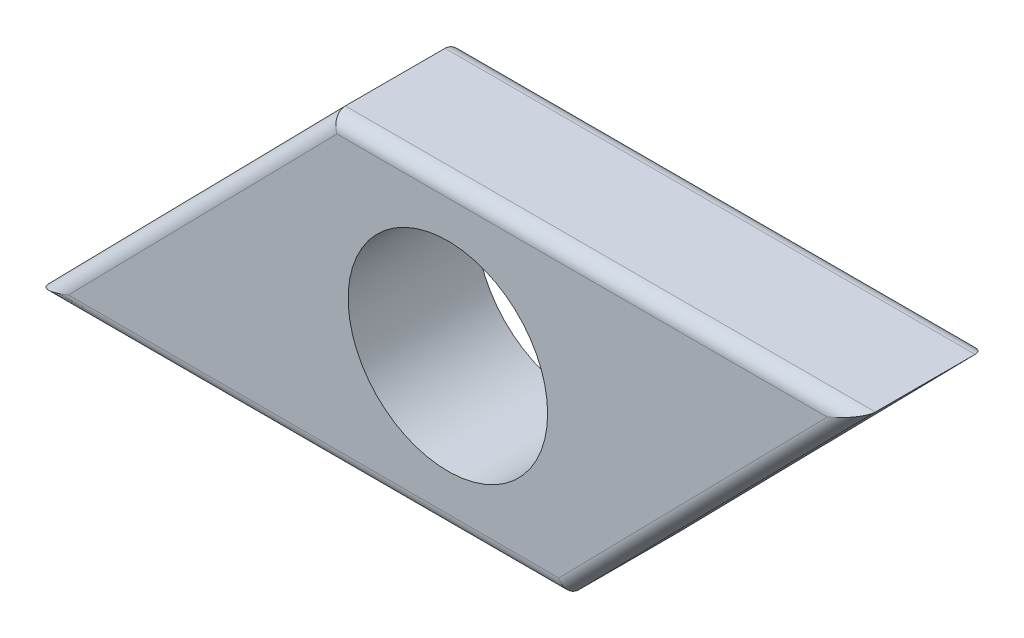
ISO-10303-21;
HEADER;
FILE_DESCRIPTION(('STEP AP214'),'2;1');
FILE_NAME('part.step','',(''),(''),'','','');
FILE_SCHEMA(('AUTOMOTIVE_DESIGN { 1 0 10303 214 1 1 1 1 }'));
ENDSEC;
DATA;
#1=APPLICATION_CONTEXT('core data for automotive mechanical design processes');
#2=APPLICATION_PROTOCOL_DEFINITION('international standard','automotive_design',2000,#1);
#3=PRODUCT_CONTEXT('',#1,'mechanical');
#4=PRODUCT('Part','Part','',(#3));
#5=PRODUCT_RELATED_PRODUCT_CATEGORY('part','',(#4));
#6=PRODUCT_DEFINITION_FORMATION('','',#4);
#7=PRODUCT_DEFINITION_CONTEXT('part definition',#1,'design');
#8=PRODUCT_DEFINITION('design','',#6,#7);
#9=PRODUCT_DEFINITION_SHAPE('','',#8);
#10=(LENGTH_UNIT() NAMED_UNIT(*) SI_UNIT(.MILLI.,.METRE.));
#11=(NAMED_UNIT(*) PLANE_ANGLE_UNIT() SI_UNIT($,.RADIAN.));
#12=(NAMED_UNIT(*) SI_UNIT($,.STERADIAN.) SOLID_ANGLE_UNIT());
#13=UNCERTAINTY_MEASURE_WITH_UNIT(LENGTH_MEASURE(1.E-05),#10,'distance_accuracy_value','');
#14=(GEOMETRIC_REPRESENTATION_CONTEXT(3) GLOBAL_UNCERTAINTY_ASSIGNED_CONTEXT((#13)) GLOBAL_UNIT_ASSIGNED_CONTEXT((#10,
#11,#12)) REPRESENTATION_CONTEXT('',''));
#15=CARTESIAN_POINT('',(0.,0.,0.));
#16=DIRECTION('',(0.,0.,1.));
#17=DIRECTION('',(1.,0.,0.));
#18=AXIS2_PLACEMENT_3D('',#15,#16,#17);
#19=CARTESIAN_POINT('',(-0.787810184205926,-1.61440170214372,2.25));
#20=DIRECTION('',(0.,0.,-1.));
#21=DIRECTION('',(-1.,0.,0.));
#22=AXIS2_PLACEMENT_3D('',#19,#20,#21);
#23=PLANE('',#22);
#24=DIRECTION('',(1.,0.,0.));
#25=VECTOR('',#24,1.);
#26=CARTESIAN_POINT('',(-0.787810184205926,-6.41440170214372,2.25));
#27=LINE('',#26,#25);
#28=CARTESIAN_POINT('',(-14.096776418891,-6.41440170214372,2.25));
#29=VERTEX_POINT('',#28);
#30=CARTESIAN_POINT('',(3.10228812595082,-6.41440170214372,2.25));
#31=VERTEX_POINT('',#30);
#32=EDGE_CURVE('E115',#29,#31,#27,.T.);
#33=ORIENTED_EDGE('',*,*,#32,.T.);
#34=DIRECTION('',(0.700340670128076,0.713808759938233,0.));
#35=VECTOR('',#34,1.);
#36=CARTESIAN_POINT('',(3.59384883143534,-5.91338790616911,2.25));
#37=LINE('',#36,#35);
#38=CARTESIAN_POINT('',(12.5211560504791,3.18559829785628,2.25));
#39=VERTEX_POINT('',#38);
#40=EDGE_CURVE('E9',#31,#39,#37,.T.);
#41=ORIENTED_EDGE('',*,*,#40,.T.);
#42=DIRECTION('',(-1.,0.,0.));
#43=VECTOR('',#42,1.);
#44=CARTESIAN_POINT('',(-0.787810184205926,3.18559829785628,2.25));
#45=LINE('',#44,#43);
#46=CARTESIAN_POINT('',(-4.67790849436266,3.18559829785628,2.25));
#47=VERTEX_POINT('',#46);
#48=EDGE_CURVE('E24',#39,#47,#45,.T.);
#49=ORIENTED_EDGE('',*,*,#48,.T.);
#50=DIRECTION('',(-0.700340670128077,-0.713808759938232,0.));
#51=VECTOR('',#50,1.);
#52=CARTESIAN_POINT('',(-5.16946919984719,2.68458450188167,2.25));
#53=LINE('',#52,#51);
#54=EDGE_CURVE('E133',#47,#29,#53,.T.);
#55=ORIENTED_EDGE('',*,*,#54,.T.);
#56=EDGE_LOOP('',(#33,#41,#49,#55));
#57=FACE_BOUND('',#56,.T.);
#58=CARTESIAN_POINT('',(-0.787810184205926,-1.61440170214372,2.25));
#59=DIRECTION('',(0.,0.,1.));
#60=DIRECTION('',(1.,0.,0.));
#61=AXIS2_PLACEMENT_3D('',#58,#59,#60);
#62=CIRCLE('',#61,3.5);
#63=CARTESIAN_POINT('',(2.71218981579407,-1.61440170214372,2.25));
#64=VERTEX_POINT('',#63);
#65=EDGE_CURVE('E160',#64,#64,#62,.T.);
#66=ORIENTED_EDGE('',*,*,#65,.F.);
#67=EDGE_LOOP('',(#66));
#68=FACE_BOUND('',#67,.T.);
#69=ADVANCED_FACE('F15',(#57,#68),#23,.F.);
#70=CARTESIAN_POINT('',(-0.787810184205926,-1.61440170214372,-2.25));
#71=DIRECTION('',(0.,0.,-1.));
#72=DIRECTION('',(-1.,0.,0.));
#73=AXIS2_PLACEMENT_3D('',#70,#71,#72);
#74=PLANE('',#73);
#75=DIRECTION('',(1.,0.,0.));
#76=VECTOR('',#75,1.);
#77=CARTESIAN_POINT('',(-15.2878101842059,-6.41440170214372,-2.25));
#78=LINE('',#77,#76);
#79=CARTESIAN_POINT('',(3.10228812595082,-6.41440170214372,-2.25));
#80=VERTEX_POINT('',#79);
#81=CARTESIAN_POINT('',(-14.096776418891,-6.41440170214372,-2.25));
#82=VERTEX_POINT('',#81);
#83=EDGE_CURVE('E151',#80,#82,#78,.F.);
#84=ORIENTED_EDGE('',*,*,#83,.T.);
#85=DIRECTION('',(-0.700340670128077,-0.713808759938232,0.));
#86=VECTOR('',#85,1.);
#87=CARTESIAN_POINT('',(-4.53090580423681,3.33542796279224,-2.25));
#88=LINE('',#87,#86);
#89=CARTESIAN_POINT('',(-4.67790849436266,3.18559829785628,-2.25));
#90=VERTEX_POINT('',#89);
#91=EDGE_CURVE('E144',#82,#90,#88,.F.);
#92=ORIENTED_EDGE('',*,*,#91,.T.);
#93=DIRECTION('',(-1.,0.,0.));
#94=VECTOR('',#93,1.);
#95=CARTESIAN_POINT('',(13.7121898157941,3.18559829785628,-2.25));
#96=LINE('',#95,#94);
#97=CARTESIAN_POINT('',(12.5211560504791,3.18559829785628,-2.25));
#98=VERTEX_POINT('',#97);
#99=EDGE_CURVE('E147',#90,#98,#96,.F.);
#100=ORIENTED_EDGE('',*,*,#99,.T.);
#101=DIRECTION('',(0.700340670128076,0.713808759938233,0.));
#102=VECTOR('',#101,1.);
#103=CARTESIAN_POINT('',(2.95528543582497,-6.56423136707969,-2.25));
#104=LINE('',#103,#102);
#105=EDGE_CURVE('E149',#98,#80,#104,.F.);
#106=ORIENTED_EDGE('',*,*,#105,.T.);
#107=EDGE_LOOP('',(#84,#92,#100,#106));
#108=FACE_BOUND('',#107,.T.);
#109=CARTESIAN_POINT('',(-0.787810184205926,-1.61440170214372,-2.25));
#110=DIRECTION('',(0.,0.,1.));
#111=DIRECTION('',(1.,0.,0.));
#112=AXIS2_PLACEMENT_3D('',#109,#110,#111);
#113=CIRCLE('',#112,3.5);
#114=CARTESIAN_POINT('',(2.71218981579407,-1.61440170214372,-2.25));
#115=VERTEX_POINT('',#114);
#116=EDGE_CURVE('E127',#115,#115,#113,.T.);
#117=ORIENTED_EDGE('',*,*,#116,.T.);
#118=EDGE_LOOP('',(#117));
#119=FACE_BOUND('',#118,.T.);
#120=ADVANCED_FACE('F170',(#108,#119),#74,.T.);
#121=CARTESIAN_POINT('',(-15.2878101842059,-6.91440170214372,2.25));
#122=DIRECTION('',(0.713808759938232,-0.700340670128077,0.));
#123=DIRECTION('',(0.700340670128077,0.713808759938232,0.));
#124=AXIS2_PLACEMENT_3D('',#121,#122,#123);
#125=PLANE('',#124);
#126=DIRECTION('',(0.,0.,-1.));
#127=VECTOR('',#126,1.);
#128=CARTESIAN_POINT('',(-4.88781018420593,3.68559829785628,2.25));
#129=LINE('',#128,#127);
#130=CARTESIAN_POINT('',(-4.88781018420593,3.68559829785628,1.75));
#131=VERTEX_POINT('',#130);
#132=CARTESIAN_POINT('',(-4.88781018420593,3.68559829785628,-1.75));
#133=VERTEX_POINT('',#132);
#134=EDGE_CURVE('E158',#131,#133,#129,.T.);
#135=ORIENTED_EDGE('',*,*,#134,.T.);
#136=DIRECTION('',(-0.700340670128077,-0.713808759938232,0.));
#137=VECTOR('',#136,1.);
#138=CARTESIAN_POINT('',(-15.2878101842059,-6.91440170214372,-1.75));
#139=LINE('',#138,#137);
#140=CARTESIAN_POINT('',(-15.2878101842059,-6.91440170214372,-1.75));
#141=VERTEX_POINT('',#140);
#142=EDGE_CURVE('E104',#133,#141,#139,.T.);
#143=ORIENTED_EDGE('',*,*,#142,.T.);
#144=DIRECTION('',(0.,0.,-1.));
#145=VECTOR('',#144,1.);
#146=CARTESIAN_POINT('',(-15.2878101842059,-6.91440170214372,2.25));
#147=LINE('',#146,#145);
#148=CARTESIAN_POINT('',(-15.2878101842059,-6.91440170214372,1.75));
#149=VERTEX_POINT('',#148);
#150=EDGE_CURVE('E86',#149,#141,#147,.T.);
#151=ORIENTED_EDGE('',*,*,#150,.F.);
#152=DIRECTION('',(-0.700340670128077,-0.713808759938232,0.));
#153=VECTOR('',#152,1.);
#154=CARTESIAN_POINT('',(-15.2878101842059,-6.91440170214372,1.75));
#155=LINE('',#154,#153);
#156=EDGE_CURVE('E101',#149,#131,#155,.F.);
#157=ORIENTED_EDGE('',*,*,#156,.T.);
#158=EDGE_LOOP('',(#135,#143,#151,#157));
#159=FACE_BOUND('',#158,.T.);
#160=ADVANCED_FACE('F100',(#159),#125,.F.);
#161=CARTESIAN_POINT('',(3.31218981579409,-6.91440170214372,2.25));
#162=DIRECTION('',(0.,1.,0.));
#163=DIRECTION('',(0.,0.,1.));
#164=AXIS2_PLACEMENT_3D('',#161,#162,#163);
#165=PLANE('',#164);
#166=ORIENTED_EDGE('',*,*,#150,.T.);
#167=DIRECTION('',(1.,0.,0.));
#168=VECTOR('',#167,1.);
#169=CARTESIAN_POINT('',(3.31218981579409,-6.91440170214372,-1.75));
#170=LINE('',#169,#168);
#171=CARTESIAN_POINT('',(3.31218981579409,-6.91440170214372,-1.75));
#172=VERTEX_POINT('',#171);
#173=EDGE_CURVE('E93',#141,#172,#170,.T.);
#174=ORIENTED_EDGE('',*,*,#173,.T.);
#175=DIRECTION('',(0.,0.,-1.));
#176=VECTOR('',#175,1.);
#177=CARTESIAN_POINT('',(3.31218981579409,-6.91440170214372,2.25));
#178=LINE('',#177,#176);
#179=CARTESIAN_POINT('',(3.31218981579409,-6.91440170214372,1.75));
#180=VERTEX_POINT('',#179);
#181=EDGE_CURVE('E88',#180,#172,#178,.T.);
#182=ORIENTED_EDGE('',*,*,#181,.F.);
#183=DIRECTION('',(1.,0.,0.));
#184=VECTOR('',#183,1.);
#185=CARTESIAN_POINT('',(3.31218981579409,-6.91440170214372,1.75));
#186=LINE('',#185,#184);
#187=EDGE_CURVE('E83',#180,#149,#186,.F.);
#188=ORIENTED_EDGE('',*,*,#187,.T.);
#189=EDGE_LOOP('',(#166,#174,#182,#188));
#190=FACE_BOUND('',#189,.T.);
#191=ADVANCED_FACE('F85',(#190),#165,.F.);
#192=CARTESIAN_POINT('',(13.7121898157941,3.68559829785628,2.25));
#193=DIRECTION('',(-0.713808759938232,0.700340670128076,0.));
#194=DIRECTION('',(-0.700340670128076,-0.713808759938233,0.));
#195=AXIS2_PLACEMENT_3D('',#192,#193,#194);
#196=PLANE('',#195);
#197=ORIENTED_EDGE('',*,*,#181,.T.);
#198=DIRECTION('',(0.700340670128076,0.713808759938233,0.));
#199=VECTOR('',#198,1.);
#200=CARTESIAN_POINT('',(13.7121898157941,3.68559829785628,-1.75));
#201=LINE('',#200,#199);
#202=CARTESIAN_POINT('',(13.7121898157941,3.68559829785628,-1.75));
#203=VERTEX_POINT('',#202);
#204=EDGE_CURVE('E94',#172,#203,#201,.T.);
#205=ORIENTED_EDGE('',*,*,#204,.T.);
#206=DIRECTION('',(0.,0.,-1.));
#207=VECTOR('',#206,1.);
#208=CARTESIAN_POINT('',(13.7121898157941,3.68559829785628,2.25));
#209=LINE('',#208,#207);
#210=CARTESIAN_POINT('',(13.7121898157941,3.68559829785628,1.75));
#211=VERTEX_POINT('',#210);
#212=EDGE_CURVE('E155',#211,#203,#209,.T.);
#213=ORIENTED_EDGE('',*,*,#212,.F.);
#214=DIRECTION('',(0.700340670128076,0.713808759938233,0.));
#215=VECTOR('',#214,1.);
#216=CARTESIAN_POINT('',(13.7121898157941,3.68559829785628,1.75));
#217=LINE('',#216,#215);
#218=EDGE_CURVE('E138',#211,#180,#217,.F.);
#219=ORIENTED_EDGE('',*,*,#218,.T.);
#220=EDGE_LOOP('',(#197,#205,#213,#219));
#221=FACE_BOUND('',#220,.T.);
#222=ADVANCED_FACE('F183',(#221),#196,.F.);
#223=CARTESIAN_POINT('',(-4.88781018420593,3.68559829785628,2.25));
#224=DIRECTION('',(0.,-1.,0.));
#225=DIRECTION('',(0.,0.,-1.));
#226=AXIS2_PLACEMENT_3D('',#223,#224,#225);
#227=PLANE('',#226);
#228=ORIENTED_EDGE('',*,*,#212,.T.);
#229=DIRECTION('',(-1.,0.,0.));
#230=VECTOR('',#229,1.);
#231=CARTESIAN_POINT('',(-4.88781018420593,3.68559829785628,-1.75));
#232=LINE('',#231,#230);
#233=EDGE_CURVE('E140',#203,#133,#232,.T.);
#234=ORIENTED_EDGE('',*,*,#233,.T.);
#235=ORIENTED_EDGE('',*,*,#134,.F.);
#236=DIRECTION('',(-1.,0.,0.));
#237=VECTOR('',#236,1.);
#238=CARTESIAN_POINT('',(-4.88781018420593,3.68559829785628,1.75));
#239=LINE('',#238,#237);
#240=EDGE_CURVE('E142',#131,#211,#239,.F.);
#241=ORIENTED_EDGE('',*,*,#240,.T.);
#242=EDGE_LOOP('',(#228,#234,#235,#241));
#243=FACE_BOUND('',#242,.T.);
#244=ADVANCED_FACE('F180',(#243),#227,.F.);
#245=CARTESIAN_POINT('',(-0.787810184205926,-1.61440170214372,2.25));
#246=DIRECTION('',(0.,0.,-1.));
#247=DIRECTION('',(-1.,0.,0.));
#248=AXIS2_PLACEMENT_3D('',#245,#246,#247);
#249=CYLINDRICAL_SURFACE('',#248,3.5);
#250=ORIENTED_EDGE('',*,*,#65,.T.);
#251=EDGE_LOOP('',(#250));
#252=FACE_BOUND('',#251,.T.);
#253=ORIENTED_EDGE('',*,*,#116,.F.);
#254=EDGE_LOOP('',(#253));
#255=FACE_BOUND('',#254,.T.);
#256=ADVANCED_FACE('F166',(#252,#255),#249,.F.);
#257=CARTESIAN_POINT('',(13.355285435825,4.03576863292032,-1.75));
#258=DIRECTION('',(-0.700340670128076,-0.713808759938233,0.));
#259=DIRECTION('',(0.713808759938233,-0.700340670128076,0.));
#260=AXIS2_PLACEMENT_3D('',#257,#258,#259);
#261=CYLINDRICAL_SURFACE('',#260,0.5);
#262=CARTESIAN_POINT('',(3.10228812595082,-6.41440170214372,-1.75));
#263=DIRECTION('',(-0.922046818260352,-0.387078370534911,0.));
#264=DIRECTION('',(-0.387078370534911,0.922046818260352,0.));
#265=AXIS2_PLACEMENT_3D('',#262,#263,#264);
#266=ELLIPSE('',#265,0.542271813207232,0.5);
#267=EDGE_CURVE('E128',#80,#172,#266,.T.);
#268=ORIENTED_EDGE('',*,*,#267,.F.);
#269=ORIENTED_EDGE('',*,*,#105,.F.);
#270=CARTESIAN_POINT('',(12.5211560504791,3.18559829785628,-1.75));
#271=DIRECTION('',(0.387078370534911,-0.922046818260352,0.));
#272=DIRECTION('',(-0.922046818260352,-0.387078370534911,0.));
#273=AXIS2_PLACEMENT_3D('',#270,#271,#272);
#274=ELLIPSE('',#273,1.29172807901676,0.5);
#275=EDGE_CURVE('E124',#203,#98,#274,.F.);
#276=ORIENTED_EDGE('',*,*,#275,.F.);
#277=ORIENTED_EDGE('',*,*,#204,.F.);
#278=EDGE_LOOP('',(#268,#269,#276,#277));
#279=FACE_BOUND('',#278,.T.);
#280=ADVANCED_FACE('F203',(#279),#261,.T.);
#281=CARTESIAN_POINT('',(-4.88781018420593,3.18559829785628,-1.75));
#282=DIRECTION('',(1.,0.,0.));
#283=DIRECTION('',(0.,0.,-1.));
#284=AXIS2_PLACEMENT_3D('',#281,#282,#283);
#285=CYLINDRICAL_SURFACE('',#284,0.5);
#286=ORIENTED_EDGE('',*,*,#275,.T.);
#287=ORIENTED_EDGE('',*,*,#99,.F.);
#288=CARTESIAN_POINT('',(-4.67790849436266,3.18559829785628,-1.75));
#289=DIRECTION('',(0.922046818260352,0.387078370534911,0.));
#290=DIRECTION('',(0.387078370534911,-0.922046818260352,0.));
#291=AXIS2_PLACEMENT_3D('',#288,#289,#290);
#292=ELLIPSE('',#291,0.542271813207232,0.5);
#293=EDGE_CURVE('E117',#133,#90,#292,.F.);
#294=ORIENTED_EDGE('',*,*,#293,.F.);
#295=ORIENTED_EDGE('',*,*,#233,.F.);
#296=EDGE_LOOP('',(#286,#287,#294,#295));
#297=FACE_BOUND('',#296,.T.);
#298=ADVANCED_FACE('F199',(#297),#285,.T.);
#299=CARTESIAN_POINT('',(3.31218981579409,-6.41440170214372,-1.75));
#300=DIRECTION('',(-1.,0.,0.));
#301=DIRECTION('',(0.,0.,1.));
#302=AXIS2_PLACEMENT_3D('',#299,#300,#301);
#303=CYLINDRICAL_SURFACE('',#302,0.5);
#304=ORIENTED_EDGE('',*,*,#267,.T.);
#305=ORIENTED_EDGE('',*,*,#173,.F.);
#306=CARTESIAN_POINT('',(-14.096776418891,-6.41440170214372,-1.75));
#307=DIRECTION('',(-0.387078370534911,0.922046818260352,0.));
#308=DIRECTION('',(-0.922046818260352,-0.387078370534911,0.));
#309=AXIS2_PLACEMENT_3D('',#306,#307,#308);
#310=ELLIPSE('',#309,1.29172807901677,0.5);
#311=EDGE_CURVE('E116',#82,#141,#310,.T.);
#312=ORIENTED_EDGE('',*,*,#311,.F.);
#313=ORIENTED_EDGE('',*,*,#83,.F.);
#314=EDGE_LOOP('',(#304,#305,#312,#313));
#315=FACE_BOUND('',#314,.T.);
#316=ADVANCED_FACE('F195',(#315),#303,.T.);
#317=CARTESIAN_POINT('',(-14.9309058042368,-7.26457203720776,-1.75));
#318=DIRECTION('',(0.700340670128077,0.713808759938232,0.));
#319=DIRECTION('',(-0.713808759938232,0.700340670128077,0.));
#320=AXIS2_PLACEMENT_3D('',#317,#318,#319);
#321=CYLINDRICAL_SURFACE('',#320,0.5);
#322=ORIENTED_EDGE('',*,*,#293,.T.);
#323=ORIENTED_EDGE('',*,*,#91,.F.);
#324=ORIENTED_EDGE('',*,*,#311,.T.);
#325=ORIENTED_EDGE('',*,*,#142,.F.);
#326=EDGE_LOOP('',(#322,#323,#324,#325));
#327=FACE_BOUND('',#326,.T.);
#328=ADVANCED_FACE('F192',(#327),#321,.T.);
#329=CARTESIAN_POINT('',(-5.16946919984719,2.68458450188167,1.75));
#330=DIRECTION('',(-0.700340670128077,-0.713808759938232,0.));
#331=DIRECTION('',(0.713808759938232,-0.700340670128077,0.));
#332=AXIS2_PLACEMENT_3D('',#329,#330,#331);
#333=CYLINDRICAL_SURFACE('',#332,0.5);
#334=CARTESIAN_POINT('',(-4.67790849436266,3.18559829785628,1.75));
#335=DIRECTION('',(-0.922046818260352,-0.387078370534911,0.));
#336=DIRECTION('',(0.387078370534911,-0.922046818260352,0.));
#337=AXIS2_PLACEMENT_3D('',#334,#335,#336);
#338=ELLIPSE('',#337,0.542271813207232,0.5);
#339=EDGE_CURVE('E111',#131,#47,#338,.F.);
#340=ORIENTED_EDGE('',*,*,#339,.F.);
#341=ORIENTED_EDGE('',*,*,#156,.F.);
#342=CARTESIAN_POINT('',(-14.096776418891,-6.41440170214372,1.75));
#343=DIRECTION('',(0.387078370534911,-0.922046818260352,0.));
#344=DIRECTION('',(0.922046818260352,0.387078370534911,0.));
#345=AXIS2_PLACEMENT_3D('',#342,#343,#344);
#346=ELLIPSE('',#345,1.29172807901677,0.5);
#347=EDGE_CURVE('E19',#29,#149,#346,.T.);
#348=ORIENTED_EDGE('',*,*,#347,.F.);
#349=ORIENTED_EDGE('',*,*,#54,.F.);
#350=EDGE_LOOP('',(#340,#341,#348,#349));
#351=FACE_BOUND('',#350,.T.);
#352=ADVANCED_FACE('F17',(#351),#333,.T.);
#353=CARTESIAN_POINT('',(-0.787810184205926,-6.41440170214372,1.75));
#354=DIRECTION('',(1.,0.,0.));
#355=DIRECTION('',(0.,0.,-1.));
#356=AXIS2_PLACEMENT_3D('',#353,#354,#355);
#357=CYLINDRICAL_SURFACE('',#356,0.5);
#358=ORIENTED_EDGE('',*,*,#347,.T.);
#359=ORIENTED_EDGE('',*,*,#187,.F.);
#360=CARTESIAN_POINT('',(3.10228812595082,-6.41440170214372,1.75));
#361=DIRECTION('',(0.922046818260352,0.387078370534911,0.));
#362=DIRECTION('',(0.387078370534911,-0.922046818260352,0.));
#363=AXIS2_PLACEMENT_3D('',#360,#361,#362);
#364=ELLIPSE('',#363,0.542271813207232,0.5);
#365=EDGE_CURVE('E119',#31,#180,#364,.T.);
#366=ORIENTED_EDGE('',*,*,#365,.F.);
#367=ORIENTED_EDGE('',*,*,#32,.F.);
#368=EDGE_LOOP('',(#358,#359,#366,#367));
#369=FACE_BOUND('',#368,.T.);
#370=ADVANCED_FACE('F114',(#369),#357,.T.);
#371=CARTESIAN_POINT('',(-0.787810184205926,3.18559829785628,1.75));
#372=DIRECTION('',(-1.,0.,0.));
#373=DIRECTION('',(0.,0.,1.));
#374=AXIS2_PLACEMENT_3D('',#371,#372,#373);
#375=CYLINDRICAL_SURFACE('',#374,0.5);
#376=ORIENTED_EDGE('',*,*,#339,.T.);
#377=ORIENTED_EDGE('',*,*,#48,.F.);
#378=CARTESIAN_POINT('',(12.5211560504791,3.18559829785628,1.75));
#379=DIRECTION('',(-0.387078370534911,0.922046818260352,0.));
#380=DIRECTION('',(-0.922046818260352,-0.387078370534911,0.));
#381=AXIS2_PLACEMENT_3D('',#378,#379,#380);
#382=ELLIPSE('',#381,1.29172807901676,0.5);
#383=EDGE_CURVE('E32',#211,#39,#382,.F.);
#384=ORIENTED_EDGE('',*,*,#383,.F.);
#385=ORIENTED_EDGE('',*,*,#240,.F.);
#386=EDGE_LOOP('',(#376,#377,#384,#385));
#387=FACE_BOUND('',#386,.T.);
#388=ADVANCED_FACE('F211',(#387),#375,.T.);
#389=CARTESIAN_POINT('',(3.59384883143534,-5.91338790616911,1.75));
#390=DIRECTION('',(0.700340670128076,0.713808759938233,0.));
#391=DIRECTION('',(-0.713808759938233,0.700340670128076,0.));
#392=AXIS2_PLACEMENT_3D('',#389,#390,#391);
#393=CYLINDRICAL_SURFACE('',#392,0.5);
#394=ORIENTED_EDGE('',*,*,#365,.T.);
#395=ORIENTED_EDGE('',*,*,#218,.F.);
#396=ORIENTED_EDGE('',*,*,#383,.T.);
#397=ORIENTED_EDGE('',*,*,#40,.F.);
#398=EDGE_LOOP('',(#394,#395,#396,#397));
#399=FACE_BOUND('',#398,.T.);
#400=ADVANCED_FACE('F208',(#399),#393,.T.);
#401=CLOSED_SHELL('',(#69,#120,#160,#191,#222,#244,#256,#280,#298,#316,#328,#352,#370,#388,#400));
#402=MANIFOLD_SOLID_BREP('B1',#401);
#403=ADVANCED_BREP_SHAPE_REPRESENTATION('',(#18,#402),#14);
#404=SHAPE_DEFINITION_REPRESENTATION(#9,#403);
ENDSEC;
END-ISO-10303-21;
